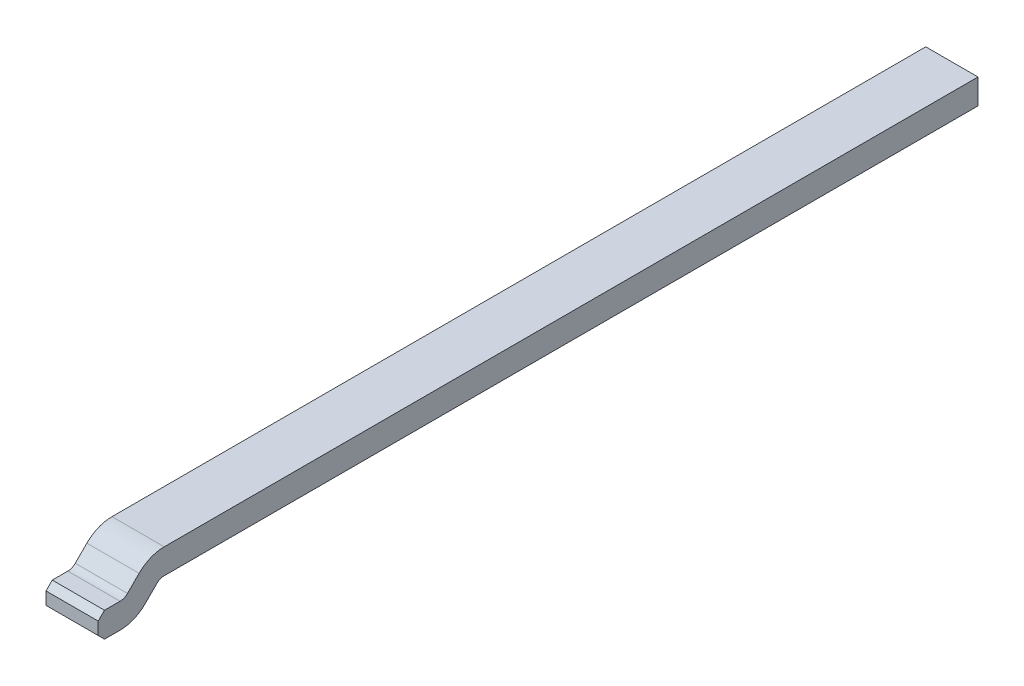
ISO-10303-21;
HEADER;
FILE_DESCRIPTION(('STEP AP214'),'2;1');
FILE_NAME('part.step','',(''),(''),'','','');
FILE_SCHEMA(('AUTOMOTIVE_DESIGN { 1 0 10303 214 1 1 1 1 }'));
ENDSEC;
DATA;
#1=APPLICATION_CONTEXT('core data for automotive mechanical design processes');
#2=APPLICATION_PROTOCOL_DEFINITION('international standard','automotive_design',2000,#1);
#3=PRODUCT_CONTEXT('',#1,'mechanical');
#4=PRODUCT('Part','Part','',(#3));
#5=PRODUCT_RELATED_PRODUCT_CATEGORY('part','',(#4));
#6=PRODUCT_DEFINITION_FORMATION('','',#4);
#7=PRODUCT_DEFINITION_CONTEXT('part definition',#1,'design');
#8=PRODUCT_DEFINITION('design','',#6,#7);
#9=PRODUCT_DEFINITION_SHAPE('','',#8);
#10=(LENGTH_UNIT() NAMED_UNIT(*) SI_UNIT(.MILLI.,.METRE.));
#11=(NAMED_UNIT(*) PLANE_ANGLE_UNIT() SI_UNIT($,.RADIAN.));
#12=(NAMED_UNIT(*) SI_UNIT($,.STERADIAN.) SOLID_ANGLE_UNIT());
#13=UNCERTAINTY_MEASURE_WITH_UNIT(LENGTH_MEASURE(1.E-05),#10,'distance_accuracy_value','');
#14=(GEOMETRIC_REPRESENTATION_CONTEXT(3) GLOBAL_UNCERTAINTY_ASSIGNED_CONTEXT((#13)) GLOBAL_UNIT_ASSIGNED_CONTEXT((#10,
#11,#12)) REPRESENTATION_CONTEXT('',''));
#15=CARTESIAN_POINT('',(0.,0.,0.));
#16=DIRECTION('',(0.,0.,1.));
#17=DIRECTION('',(1.,0.,0.));
#18=AXIS2_PLACEMENT_3D('',#15,#16,#17);
#19=CARTESIAN_POINT('',(15.16210814532,12.93951558355,-11.91169883308));
#20=DIRECTION('',(-1.,0.,0.));
#21=DIRECTION('',(0.,1.,0.));
#22=AXIS2_PLACEMENT_3D('',#19,#20,#21);
#23=PLANE('',#22);
#24=DIRECTION('',(0.,1.,0.));
#25=VECTOR('',#24,1.);
#26=CARTESIAN_POINT('',(15.16210814532,11.48941215274,-9.67169883308));
#27=LINE('',#26,#25);
#28=CARTESIAN_POINT('',(15.1621081907637,13.39951558355,-9.67169883308001));
#29=VERTEX_POINT('',#28);
#30=CARTESIAN_POINT('',(15.1621081907572,13.51951558355,-9.67169883308001));
#31=VERTEX_POINT('',#30);
#32=EDGE_CURVE('E28',#29,#31,#27,.T.);
#33=ORIENTED_EDGE('',*,*,#32,.F.);
#34=DIRECTION('',(0.,0.,-1.));
#35=VECTOR('',#34,1.);
#36=CARTESIAN_POINT('',(15.16210823657,13.39951558355,-5.731698833076));
#37=LINE('',#36,#35);
#38=CARTESIAN_POINT('',(15.162108236201,13.39951558355,-5.77711513867901));
#39=VERTEX_POINT('',#38);
#40=EDGE_CURVE('E126',#39,#29,#37,.T.);
#41=ORIENTED_EDGE('',*,*,#40,.F.);
#42=CARTESIAN_POINT('',(15.16210823657,13.34951558355,-5.777115138679));
#43=DIRECTION('',(-1.,0.,0.));
#44=DIRECTION('',(0.,0.,1.));
#45=AXIS2_PLACEMENT_3D('',#42,#43,#44);
#46=CIRCLE('',#45,0.05);
#47=CARTESIAN_POINT('',(15.162108236201,13.3848709226099,-5.74175979962007));
#48=VERTEX_POINT('',#47);
#49=EDGE_CURVE('E120',#48,#39,#46,.T.);
#50=ORIENTED_EDGE('',*,*,#49,.F.);
#51=DIRECTION('',(0.,0.707106781180048,-0.707106781193047));
#52=VECTOR('',#51,1.);
#53=CARTESIAN_POINT('',(15.16210823657,13.32930743075,-5.686196307759));
#54=LINE('',#53,#52);
#55=CARTESIAN_POINT('',(15.162108236201,13.3293074307494,-5.6861963077595));
#56=VERTEX_POINT('',#55);
#57=EDGE_CURVE('E123',#56,#48,#54,.T.);
#58=ORIENTED_EDGE('',*,*,#57,.F.);
#59=CARTESIAN_POINT('',(15.16210823657,13.44951558355,-5.565988154957));
#60=DIRECTION('',(1.,0.,0.));
#61=DIRECTION('',(0.,0.,1.));
#62=AXIS2_PLACEMENT_3D('',#59,#60,#61);
#63=CIRCLE('',#62,0.17);
#64=CARTESIAN_POINT('',(15.162108236201,13.27951558355,-5.56598815495699));
#65=VERTEX_POINT('',#64);
#66=EDGE_CURVE('E195',#65,#56,#63,.T.);
#67=ORIENTED_EDGE('',*,*,#66,.F.);
#68=DIRECTION('',(0.,0.,-1.));
#69=VECTOR('',#68,1.);
#70=CARTESIAN_POINT('',(15.16210823657,13.27951558355,-5.731698833076));
#71=LINE('',#70,#69);
#72=CARTESIAN_POINT('',(15.162108236201,13.27951558355,-5.491404460561));
#73=VERTEX_POINT('',#72);
#74=EDGE_CURVE('E160',#73,#65,#71,.T.);
#75=ORIENTED_EDGE('',*,*,#74,.F.);
#76=DIRECTION('',(0.,-0.707106781186548,-0.707106781186548));
#77=VECTOR('',#76,1.);
#78=CARTESIAN_POINT('',(15.16210823657,13.30951558355,-5.461404460561));
#79=LINE('',#78,#77);
#80=CARTESIAN_POINT('',(15.162108236201,13.30951558355,-5.461404460561));
#81=VERTEX_POINT('',#80);
#82=EDGE_CURVE('E168',#81,#73,#79,.T.);
#83=ORIENTED_EDGE('',*,*,#82,.F.);
#84=DIRECTION('',(0.,-1.,0.));
#85=VECTOR('',#84,1.);
#86=CARTESIAN_POINT('',(15.16210823657,13.39951558355,-5.461404460561));
#87=LINE('',#86,#85);
#88=CARTESIAN_POINT('',(15.162108236201,13.36951558355,-5.461404460561));
#89=VERTEX_POINT('',#88);
#90=EDGE_CURVE('E190',#89,#81,#87,.T.);
#91=ORIENTED_EDGE('',*,*,#90,.F.);
#92=DIRECTION('',(0.,-0.707106781186548,0.707106781186548));
#93=VECTOR('',#92,1.);
#94=CARTESIAN_POINT('',(15.16210823657,13.39951558355,-5.491404460561));
#95=LINE('',#94,#93);
#96=CARTESIAN_POINT('',(15.162108236201,13.39951558355,-5.49140446056099));
#97=VERTEX_POINT('',#96);
#98=EDGE_CURVE('E200',#97,#89,#95,.T.);
#99=ORIENTED_EDGE('',*,*,#98,.F.);
#100=DIRECTION('',(0.,0.,1.));
#101=VECTOR('',#100,1.);
#102=CARTESIAN_POINT('',(15.16210823657,13.39951558355,-5.731698833076));
#103=LINE('',#102,#101);
#104=CARTESIAN_POINT('',(15.162108236201,13.39951558355,-5.56598815495699));
#105=VERTEX_POINT('',#104);
#106=EDGE_CURVE('E216',#105,#97,#103,.T.);
#107=ORIENTED_EDGE('',*,*,#106,.F.);
#108=CARTESIAN_POINT('',(15.16210823657,13.44951558355,-5.565988154957));
#109=DIRECTION('',(-1.,0.,0.));
#110=DIRECTION('',(0.,0.,-1.));
#111=AXIS2_PLACEMENT_3D('',#108,#109,#110);
#112=CIRCLE('',#111,0.05);
#113=CARTESIAN_POINT('',(15.162108236201,13.4141602444906,-5.60134349401644));
#114=VERTEX_POINT('',#113);
#115=EDGE_CURVE('E191',#114,#105,#112,.T.);
#116=ORIENTED_EDGE('',*,*,#115,.F.);
#117=DIRECTION('',(0.,-0.707106781180048,0.707106781193047));
#118=VECTOR('',#117,1.);
#119=CARTESIAN_POINT('',(15.16210823657,13.46972373635,-5.656906985878));
#120=LINE('',#119,#118);
#121=CARTESIAN_POINT('',(15.162108236201,13.4697237363508,-5.65690698587733));
#122=VERTEX_POINT('',#121);
#123=EDGE_CURVE('E21',#122,#114,#120,.T.);
#124=ORIENTED_EDGE('',*,*,#123,.F.);
#125=CARTESIAN_POINT('',(15.16210823657,13.34951558355,-5.777115138679));
#126=DIRECTION('',(1.,0.,0.));
#127=DIRECTION('',(0.,0.,-1.));
#128=AXIS2_PLACEMENT_3D('',#125,#126,#127);
#129=CIRCLE('',#128,0.17);
#130=CARTESIAN_POINT('',(15.162108236201,13.51951558355,-5.77711513867901));
#131=VERTEX_POINT('',#130);
#132=EDGE_CURVE('E173',#131,#122,#129,.T.);
#133=ORIENTED_EDGE('',*,*,#132,.F.);
#134=DIRECTION('',(0.,0.,1.));
#135=VECTOR('',#134,1.);
#136=CARTESIAN_POINT('',(15.16210823657,13.51951558355,-7.369063364689));
#137=LINE('',#136,#135);
#138=EDGE_CURVE('E231',#31,#131,#137,.T.);
#139=ORIENTED_EDGE('',*,*,#138,.F.);
#140=EDGE_LOOP('',(#33,#41,#50,#58,#67,#75,#83,#91,#99,#107,#116,#124,#133,#139));
#141=FACE_BOUND('',#140,.T.);
#142=ADVANCED_FACE('F17',(#141),#23,.T.);
#143=CARTESIAN_POINT('',(15.41210814532,12.93951558355,-10.71169883308));
#144=DIRECTION('',(1.,0.,0.));
#145=DIRECTION('',(0.,0.,-1.));
#146=AXIS2_PLACEMENT_3D('',#143,#144,#145);
#147=PLANE('',#146);
#148=DIRECTION('',(0.,0.,-1.));
#149=VECTOR('',#148,1.);
#150=CARTESIAN_POINT('',(15.41210823657,13.39951558355,-12.98169883308));
#151=LINE('',#150,#149);
#152=CARTESIAN_POINT('',(15.412108236201,13.39951558355,-5.77711513867901));
#153=VERTEX_POINT('',#152);
#154=CARTESIAN_POINT('',(15.412108236201,13.39951558355,-9.67169883308001));
#155=VERTEX_POINT('',#154);
#156=EDGE_CURVE('E132',#153,#155,#151,.T.);
#157=ORIENTED_EDGE('',*,*,#156,.T.);
#158=DIRECTION('',(0.,1.,0.));
#159=VECTOR('',#158,1.);
#160=CARTESIAN_POINT('',(15.41210823657,11.48941215274,-9.67169883308));
#161=LINE('',#160,#159);
#162=CARTESIAN_POINT('',(15.412108236201,13.51951558355,-9.67169883308001));
#163=VERTEX_POINT('',#162);
#164=EDGE_CURVE('E11',#155,#163,#161,.T.);
#165=ORIENTED_EDGE('',*,*,#164,.T.);
#166=DIRECTION('',(0.,0.,-1.));
#167=VECTOR('',#166,1.);
#168=CARTESIAN_POINT('',(15.41210823657,13.51951558355,-7.369063364689));
#169=LINE('',#168,#167);
#170=CARTESIAN_POINT('',(15.412108236201,13.51951558355,-5.77711513867901));
#171=VERTEX_POINT('',#170);
#172=EDGE_CURVE('E235',#171,#163,#169,.T.);
#173=ORIENTED_EDGE('',*,*,#172,.F.);
#174=CARTESIAN_POINT('',(15.41210823657,13.34951558355,-5.777115138679));
#175=DIRECTION('',(1.,0.,0.));
#176=DIRECTION('',(0.,0.,-1.));
#177=AXIS2_PLACEMENT_3D('',#174,#175,#176);
#178=CIRCLE('',#177,0.17);
#179=CARTESIAN_POINT('',(15.412108236201,13.4697237363509,-5.65690698587746));
#180=VERTEX_POINT('',#179);
#181=EDGE_CURVE('E176',#171,#180,#178,.T.);
#182=ORIENTED_EDGE('',*,*,#181,.T.);
#183=DIRECTION('',(0.,-0.707106781174048,0.707106781199048));
#184=VECTOR('',#183,1.);
#185=CARTESIAN_POINT('',(15.41210823657,13.46972373635,-5.656906985878));
#186=LINE('',#185,#184);
#187=CARTESIAN_POINT('',(15.412108236201,13.4141602444907,-5.60134349401621));
#188=VERTEX_POINT('',#187);
#189=EDGE_CURVE('E185',#180,#188,#186,.T.);
#190=ORIENTED_EDGE('',*,*,#189,.T.);
#191=CARTESIAN_POINT('',(15.41210823657,13.44951558355,-5.565988154957));
#192=DIRECTION('',(-1.,0.,0.));
#193=DIRECTION('',(0.,0.,-1.));
#194=AXIS2_PLACEMENT_3D('',#191,#192,#193);
#195=CIRCLE('',#194,0.05);
#196=CARTESIAN_POINT('',(15.412108236201,13.39951558355,-5.56598815495699));
#197=VERTEX_POINT('',#196);
#198=EDGE_CURVE('E213',#188,#197,#195,.T.);
#199=ORIENTED_EDGE('',*,*,#198,.T.);
#200=DIRECTION('',(0.,0.,1.));
#201=VECTOR('',#200,1.);
#202=CARTESIAN_POINT('',(15.41210823657,13.39951558355,-12.98169883308));
#203=LINE('',#202,#201);
#204=CARTESIAN_POINT('',(15.412108236201,13.39951558355,-5.49140446056099));
#205=VERTEX_POINT('',#204);
#206=EDGE_CURVE('E204',#197,#205,#203,.T.);
#207=ORIENTED_EDGE('',*,*,#206,.T.);
#208=DIRECTION('',(0.,-0.707106781186548,0.707106781186548));
#209=VECTOR('',#208,1.);
#210=CARTESIAN_POINT('',(15.41210823657,13.39951558355,-5.491404460561));
#211=LINE('',#210,#209);
#212=CARTESIAN_POINT('',(15.412108236201,13.36951558355,-5.461404460561));
#213=VERTEX_POINT('',#212);
#214=EDGE_CURVE('E186',#205,#213,#211,.T.);
#215=ORIENTED_EDGE('',*,*,#214,.T.);
#216=DIRECTION('',(0.,-1.,0.));
#217=VECTOR('',#216,1.);
#218=CARTESIAN_POINT('',(15.41210823657,13.67951558355,-5.461404460561));
#219=LINE('',#218,#217);
#220=CARTESIAN_POINT('',(15.412108236201,13.30951558355,-5.461404460561));
#221=VERTEX_POINT('',#220);
#222=EDGE_CURVE('E165',#213,#221,#219,.T.);
#223=ORIENTED_EDGE('',*,*,#222,.T.);
#224=DIRECTION('',(0.,-0.707106781186548,-0.707106781186548));
#225=VECTOR('',#224,1.);
#226=CARTESIAN_POINT('',(15.41210823657,13.30951558355,-5.461404460561));
#227=LINE('',#226,#225);
#228=CARTESIAN_POINT('',(15.412108236201,13.27951558355,-5.491404460561));
#229=VERTEX_POINT('',#228);
#230=EDGE_CURVE('E159',#221,#229,#227,.T.);
#231=ORIENTED_EDGE('',*,*,#230,.T.);
#232=DIRECTION('',(0.,0.,-1.));
#233=VECTOR('',#232,1.);
#234=CARTESIAN_POINT('',(15.41210823657,13.27951558355,-12.98169883308));
#235=LINE('',#234,#233);
#236=CARTESIAN_POINT('',(15.412108236201,13.27951558355,-5.565988154957));
#237=VERTEX_POINT('',#236);
#238=EDGE_CURVE('E156',#229,#237,#235,.T.);
#239=ORIENTED_EDGE('',*,*,#238,.T.);
#240=CARTESIAN_POINT('',(15.41210823657,13.44951558355,-5.565988154957));
#241=DIRECTION('',(1.,0.,0.));
#242=DIRECTION('',(0.,0.,1.));
#243=AXIS2_PLACEMENT_3D('',#240,#241,#242);
#244=CIRCLE('',#243,0.17);
#245=CARTESIAN_POINT('',(15.412108236201,13.3293074307494,-5.6861963077595));
#246=VERTEX_POINT('',#245);
#247=EDGE_CURVE('E142',#237,#246,#244,.T.);
#248=ORIENTED_EDGE('',*,*,#247,.T.);
#249=DIRECTION('',(0.,0.707106781180048,-0.707106781193047));
#250=VECTOR('',#249,1.);
#251=CARTESIAN_POINT('',(15.41210823657,13.32930743075,-5.686196307759));
#252=LINE('',#251,#250);
#253=CARTESIAN_POINT('',(15.412108236201,13.3848709226099,-5.74175979962007));
#254=VERTEX_POINT('',#253);
#255=EDGE_CURVE('E148',#246,#254,#252,.T.);
#256=ORIENTED_EDGE('',*,*,#255,.T.);
#257=CARTESIAN_POINT('',(15.41210823657,13.34951558355,-5.777115138679));
#258=DIRECTION('',(-1.,0.,0.));
#259=DIRECTION('',(0.,0.,1.));
#260=AXIS2_PLACEMENT_3D('',#257,#258,#259);
#261=CIRCLE('',#260,0.05);
#262=EDGE_CURVE('E133',#254,#153,#261,.T.);
#263=ORIENTED_EDGE('',*,*,#262,.T.);
#264=EDGE_LOOP('',(#157,#165,#173,#182,#190,#199,#207,#215,#223,#231,#239,#248,#256,#263));
#265=FACE_BOUND('',#264,.T.);
#266=ADVANCED_FACE('F297',(#265),#147,.T.);
#267=CARTESIAN_POINT('',(13.11210817501,5.079903349409,-9.67169883308));
#268=DIRECTION('',(0.,0.,-1.));
#269=DIRECTION('',(-1.,0.,0.));
#270=AXIS2_PLACEMENT_3D('',#267,#268,#269);
#271=PLANE('',#270);
#272=DIRECTION('',(1.,0.,0.));
#273=VECTOR('',#272,1.);
#274=CARTESIAN_POINT('',(12.51210817501,13.39951558355,-9.67169883308));
#275=LINE('',#274,#273);
#276=EDGE_CURVE('E161',#29,#155,#275,.T.);
#277=ORIENTED_EDGE('',*,*,#276,.F.);
#278=ORIENTED_EDGE('',*,*,#32,.T.);
#279=DIRECTION('',(-1.,0.,0.));
#280=VECTOR('',#279,1.);
#281=CARTESIAN_POINT('',(13.0621082047,13.51951558355,-9.67169883308));
#282=LINE('',#281,#280);
#283=EDGE_CURVE('E180',#163,#31,#282,.T.);
#284=ORIENTED_EDGE('',*,*,#283,.F.);
#285=ORIENTED_EDGE('',*,*,#164,.F.);
#286=EDGE_LOOP('',(#277,#278,#284,#285));
#287=FACE_BOUND('',#286,.T.);
#288=ADVANCED_FACE('F327',(#287),#271,.T.);
#289=CARTESIAN_POINT('',(12.5121082047,13.39951558355,-11.38169883308));
#290=DIRECTION('',(0.,1.,0.));
#291=DIRECTION('',(1.,0.,0.));
#292=AXIS2_PLACEMENT_3D('',#289,#290,#291);
#293=PLANE('',#292);
#294=ORIENTED_EDGE('',*,*,#156,.F.);
#295=DIRECTION('',(1.,0.,0.));
#296=VECTOR('',#295,1.);
#297=CARTESIAN_POINT('',(12.5121082047,13.39951558355,-5.777115138679));
#298=LINE('',#297,#296);
#299=EDGE_CURVE('E219',#39,#153,#298,.T.);
#300=ORIENTED_EDGE('',*,*,#299,.F.);
#301=ORIENTED_EDGE('',*,*,#40,.T.);
#302=ORIENTED_EDGE('',*,*,#276,.T.);
#303=EDGE_LOOP('',(#294,#300,#301,#302));
#304=FACE_BOUND('',#303,.T.);
#305=ADVANCED_FACE('F329',(#304),#293,.F.);
#306=CARTESIAN_POINT('',(12.5121082047,13.34951558355,-5.777115138679));
#307=DIRECTION('',(1.,0.,0.));
#308=DIRECTION('',(0.,0.,1.));
#309=AXIS2_PLACEMENT_3D('',#306,#307,#308);
#310=CYLINDRICAL_SURFACE('',#309,0.05);
#311=ORIENTED_EDGE('',*,*,#299,.T.);
#312=ORIENTED_EDGE('',*,*,#262,.F.);
#313=DIRECTION('',(1.,0.,0.));
#314=VECTOR('',#313,1.);
#315=CARTESIAN_POINT('',(12.5121082047,13.38487092261,-5.74175979962));
#316=LINE('',#315,#314);
#317=EDGE_CURVE('E138',#48,#254,#316,.T.);
#318=ORIENTED_EDGE('',*,*,#317,.F.);
#319=ORIENTED_EDGE('',*,*,#49,.T.);
#320=EDGE_LOOP('',(#311,#312,#318,#319));
#321=FACE_BOUND('',#320,.T.);
#322=ADVANCED_FACE('F144',(#321),#310,.F.);
#323=CARTESIAN_POINT('',(13.0621082047,13.51951558355,-7.369063364689));
#324=DIRECTION('',(0.,1.,0.));
#325=DIRECTION('',(1.,0.,0.));
#326=AXIS2_PLACEMENT_3D('',#323,#324,#325);
#327=PLANE('',#326);
#328=ORIENTED_EDGE('',*,*,#283,.T.);
#329=ORIENTED_EDGE('',*,*,#138,.T.);
#330=DIRECTION('',(1.,0.,0.));
#331=VECTOR('',#330,1.);
#332=CARTESIAN_POINT('',(13.0621082047,13.51951558355,-5.777115138679));
#333=LINE('',#332,#331);
#334=EDGE_CURVE('E177',#131,#171,#333,.T.);
#335=ORIENTED_EDGE('',*,*,#334,.T.);
#336=ORIENTED_EDGE('',*,*,#172,.T.);
#337=EDGE_LOOP('',(#328,#329,#335,#336));
#338=FACE_BOUND('',#337,.T.);
#339=ADVANCED_FACE('F320',(#338),#327,.T.);
#340=CARTESIAN_POINT('',(13.0621082047,13.34951558355,-5.777115138679));
#341=DIRECTION('',(-1.,0.,0.));
#342=DIRECTION('',(0.,0.,-1.));
#343=AXIS2_PLACEMENT_3D('',#340,#341,#342);
#344=CYLINDRICAL_SURFACE('',#343,0.17);
#345=ORIENTED_EDGE('',*,*,#334,.F.);
#346=ORIENTED_EDGE('',*,*,#132,.T.);
#347=DIRECTION('',(1.,0.,0.));
#348=VECTOR('',#347,1.);
#349=CARTESIAN_POINT('',(13.0621082047,13.469723736351,-5.656906985877));
#350=LINE('',#349,#348);
#351=EDGE_CURVE('E181',#122,#180,#350,.T.);
#352=ORIENTED_EDGE('',*,*,#351,.T.);
#353=ORIENTED_EDGE('',*,*,#181,.F.);
#354=EDGE_LOOP('',(#345,#346,#352,#353));
#355=FACE_BOUND('',#354,.T.);
#356=ADVANCED_FACE('F325',(#355),#344,.T.);
#357=CARTESIAN_POINT('',(16.91210823377,13.39951558355,-5.586698833076));
#358=DIRECTION('',(0.,0.707106781186048,0.707106781187048));
#359=DIRECTION('',(1.,0.,0.));
#360=AXIS2_PLACEMENT_3D('',#357,#358,#359);
#361=PLANE('',#360);
#362=DIRECTION('',(1.,0.,0.));
#363=VECTOR('',#362,1.);
#364=CARTESIAN_POINT('',(16.91210823377,13.414160244491,-5.601343494016));
#365=LINE('',#364,#363);
#366=EDGE_CURVE('E194',#114,#188,#365,.T.);
#367=ORIENTED_EDGE('',*,*,#366,.T.);
#368=ORIENTED_EDGE('',*,*,#189,.F.);
#369=ORIENTED_EDGE('',*,*,#351,.F.);
#370=ORIENTED_EDGE('',*,*,#123,.T.);
#371=EDGE_LOOP('',(#367,#368,#369,#370));
#372=FACE_BOUND('',#371,.T.);
#373=ADVANCED_FACE('F394',(#372),#361,.T.);
#374=CARTESIAN_POINT('',(16.91210823377,13.44951558355,-5.565988154957));
#375=DIRECTION('',(-1.,0.,0.));
#376=DIRECTION('',(0.,0.,-1.));
#377=AXIS2_PLACEMENT_3D('',#374,#375,#376);
#378=CYLINDRICAL_SURFACE('',#377,0.05);
#379=DIRECTION('',(1.,0.,0.));
#380=VECTOR('',#379,1.);
#381=CARTESIAN_POINT('',(17.56534248199,13.39951558355,-5.565988154957));
#382=LINE('',#381,#380);
#383=EDGE_CURVE('E243',#105,#197,#382,.T.);
#384=ORIENTED_EDGE('',*,*,#383,.T.);
#385=ORIENTED_EDGE('',*,*,#198,.F.);
#386=ORIENTED_EDGE('',*,*,#366,.F.);
#387=ORIENTED_EDGE('',*,*,#115,.T.);
#388=EDGE_LOOP('',(#384,#385,#386,#387));
#389=FACE_BOUND('',#388,.T.);
#390=ADVANCED_FACE('F302',(#389),#378,.F.);
#391=CARTESIAN_POINT('',(17.56534248199,13.39951558355,-5.535988154957));
#392=DIRECTION('',(0.,-1.,-1.402976681707E-13));
#393=DIRECTION('',(0.,1.402976681707E-13,-1.));
#394=AXIS2_PLACEMENT_3D('',#391,#392,#393);
#395=PLANE('',#394);
#396=ORIENTED_EDGE('',*,*,#206,.F.);
#397=ORIENTED_EDGE('',*,*,#383,.F.);
#398=ORIENTED_EDGE('',*,*,#106,.T.);
#399=DIRECTION('',(-1.,0.,0.));
#400=VECTOR('',#399,1.);
#401=CARTESIAN_POINT('',(16.91210823377,13.39951558355,-5.491404460561));
#402=LINE('',#401,#400);
#403=EDGE_CURVE('E189',#205,#97,#402,.T.);
#404=ORIENTED_EDGE('',*,*,#403,.F.);
#405=EDGE_LOOP('',(#396,#397,#398,#404));
#406=FACE_BOUND('',#405,.T.);
#407=ADVANCED_FACE('F285',(#406),#395,.F.);
#408=CARTESIAN_POINT('',(16.91210823377,13.36951558355,-5.461404460561));
#409=DIRECTION('',(0.,0.707106781186048,0.707106781187048));
#410=DIRECTION('',(1.,0.,0.));
#411=AXIS2_PLACEMENT_3D('',#408,#409,#410);
#412=PLANE('',#411);
#413=DIRECTION('',(-1.,0.,0.));
#414=VECTOR('',#413,1.);
#415=CARTESIAN_POINT('',(16.91210823377,13.36951558355,-5.461404460561));
#416=LINE('',#415,#414);
#417=EDGE_CURVE('E167',#213,#89,#416,.T.);
#418=ORIENTED_EDGE('',*,*,#417,.F.);
#419=ORIENTED_EDGE('',*,*,#214,.F.);
#420=ORIENTED_EDGE('',*,*,#403,.T.);
#421=ORIENTED_EDGE('',*,*,#98,.T.);
#422=EDGE_LOOP('',(#418,#419,#420,#421));
#423=FACE_BOUND('',#422,.T.);
#424=ADVANCED_FACE('F294',(#423),#412,.T.);
#425=CARTESIAN_POINT('',(16.91210823377,13.27951558355,-5.461404460561));
#426=DIRECTION('',(0.,0.,1.));
#427=DIRECTION('',(1.,0.,0.));
#428=AXIS2_PLACEMENT_3D('',#425,#426,#427);
#429=PLANE('',#428);
#430=DIRECTION('',(1.,0.,0.));
#431=VECTOR('',#430,1.);
#432=CARTESIAN_POINT('',(16.91210823377,13.30951558355,-5.461404460561));
#433=LINE('',#432,#431);
#434=EDGE_CURVE('E171',#81,#221,#433,.T.);
#435=ORIENTED_EDGE('',*,*,#434,.T.);
#436=ORIENTED_EDGE('',*,*,#222,.F.);
#437=ORIENTED_EDGE('',*,*,#417,.T.);
#438=ORIENTED_EDGE('',*,*,#90,.T.);
#439=EDGE_LOOP('',(#435,#436,#437,#438));
#440=FACE_BOUND('',#439,.T.);
#441=ADVANCED_FACE('F375',(#440),#429,.T.);
#442=CARTESIAN_POINT('',(16.91210823377,13.27951558355,-5.491404460561));
#443=DIRECTION('',(0.,0.707106781186548,-0.707106781186548));
#444=DIRECTION('',(-1.,0.,0.));
#445=AXIS2_PLACEMENT_3D('',#442,#443,#444);
#446=PLANE('',#445);
#447=DIRECTION('',(-1.,0.,0.));
#448=VECTOR('',#447,1.);
#449=CARTESIAN_POINT('',(16.91210823377,13.27951558355,-5.491404460561));
#450=LINE('',#449,#448);
#451=EDGE_CURVE('E197',#229,#73,#450,.T.);
#452=ORIENTED_EDGE('',*,*,#451,.F.);
#453=ORIENTED_EDGE('',*,*,#230,.F.);
#454=ORIENTED_EDGE('',*,*,#434,.F.);
#455=ORIENTED_EDGE('',*,*,#82,.T.);
#456=EDGE_LOOP('',(#452,#453,#454,#455));
#457=FACE_BOUND('',#456,.T.);
#458=ADVANCED_FACE('F384',(#457),#446,.F.);
#459=CARTESIAN_POINT('',(16.91210823377,13.27951558355,-5.661404460561));
#460=DIRECTION('',(0.,-1.,0.));
#461=DIRECTION('',(0.,0.,-1.));
#462=AXIS2_PLACEMENT_3D('',#459,#460,#461);
#463=PLANE('',#462);
#464=ORIENTED_EDGE('',*,*,#451,.T.);
#465=ORIENTED_EDGE('',*,*,#74,.T.);
#466=DIRECTION('',(-1.,0.,0.));
#467=VECTOR('',#466,1.);
#468=CARTESIAN_POINT('',(16.91210823377,13.27951558355,-5.565988154957));
#469=LINE('',#468,#467);
#470=EDGE_CURVE('E198',#237,#65,#469,.T.);
#471=ORIENTED_EDGE('',*,*,#470,.F.);
#472=ORIENTED_EDGE('',*,*,#238,.F.);
#473=EDGE_LOOP('',(#464,#465,#471,#472));
#474=FACE_BOUND('',#473,.T.);
#475=ADVANCED_FACE('F399',(#474),#463,.T.);
#476=CARTESIAN_POINT('',(16.91210823377,13.44951558355,-5.565988154957));
#477=DIRECTION('',(1.,0.,0.));
#478=DIRECTION('',(0.,0.,1.));
#479=AXIS2_PLACEMENT_3D('',#476,#477,#478);
#480=CYLINDRICAL_SURFACE('',#479,0.17);
#481=DIRECTION('',(-1.,0.,0.));
#482=VECTOR('',#481,1.);
#483=CARTESIAN_POINT('',(16.91210823377,13.329307430749,-5.68619630776));
#484=LINE('',#483,#482);
#485=EDGE_CURVE('E140',#246,#56,#484,.T.);
#486=ORIENTED_EDGE('',*,*,#485,.F.);
#487=ORIENTED_EDGE('',*,*,#247,.F.);
#488=ORIENTED_EDGE('',*,*,#470,.T.);
#489=ORIENTED_EDGE('',*,*,#66,.T.);
#490=EDGE_LOOP('',(#486,#487,#488,#489));
#491=FACE_BOUND('',#490,.T.);
#492=ADVANCED_FACE('F334',(#491),#480,.T.);
#493=CARTESIAN_POINT('',(16.91210823377,13.39951558355,-5.756404460561));
#494=DIRECTION('',(0.,-0.707106781187048,-0.707106781186048));
#495=DIRECTION('',(0.,0.707106781186048,-0.707106781187048));
#496=AXIS2_PLACEMENT_3D('',#493,#494,#495);
#497=PLANE('',#496);
#498=ORIENTED_EDGE('',*,*,#317,.T.);
#499=ORIENTED_EDGE('',*,*,#255,.F.);
#500=ORIENTED_EDGE('',*,*,#485,.T.);
#501=ORIENTED_EDGE('',*,*,#57,.T.);
#502=EDGE_LOOP('',(#498,#499,#500,#501));
#503=FACE_BOUND('',#502,.T.);
#504=ADVANCED_FACE('F19',(#503),#497,.T.);
#505=CLOSED_SHELL('',(#142,#266,#288,#305,#322,#339,#356,#373,#390,#407,#424,#441,#458,#475,
#492,#504));
#506=MANIFOLD_SOLID_BREP('B1',#505);
#507=ADVANCED_BREP_SHAPE_REPRESENTATION('',(#18,#506),#14);
#508=SHAPE_DEFINITION_REPRESENTATION(#9,#507);
ENDSEC;
END-ISO-10303-21;
